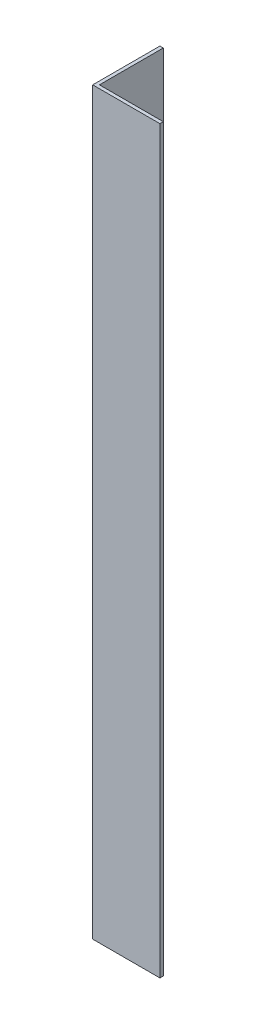
ISO-10303-21;
HEADER;
FILE_DESCRIPTION(('STEP AP214'),'2;1');
FILE_NAME('part.step','',(''),(''),'','','');
FILE_SCHEMA(('AUTOMOTIVE_DESIGN { 1 0 10303 214 1 1 1 1 }'));
ENDSEC;
DATA;
#1=APPLICATION_CONTEXT('core data for automotive mechanical design processes');
#2=APPLICATION_PROTOCOL_DEFINITION('international standard','automotive_design',2000,#1);
#3=PRODUCT_CONTEXT('',#1,'mechanical');
#4=PRODUCT('Part','Part','',(#3));
#5=PRODUCT_RELATED_PRODUCT_CATEGORY('part','',(#4));
#6=PRODUCT_DEFINITION_FORMATION('','',#4);
#7=PRODUCT_DEFINITION_CONTEXT('part definition',#1,'design');
#8=PRODUCT_DEFINITION('design','',#6,#7);
#9=PRODUCT_DEFINITION_SHAPE('','',#8);
#10=(LENGTH_UNIT() NAMED_UNIT(*) SI_UNIT(.MILLI.,.METRE.));
#11=(NAMED_UNIT(*) PLANE_ANGLE_UNIT() SI_UNIT($,.RADIAN.));
#12=(NAMED_UNIT(*) SI_UNIT($,.STERADIAN.) SOLID_ANGLE_UNIT());
#13=UNCERTAINTY_MEASURE_WITH_UNIT(LENGTH_MEASURE(1.E-05),#10,'distance_accuracy_value','');
#14=(GEOMETRIC_REPRESENTATION_CONTEXT(3) GLOBAL_UNCERTAINTY_ASSIGNED_CONTEXT((#13)) GLOBAL_UNIT_ASSIGNED_CONTEXT((#10,
#11,#12)) REPRESENTATION_CONTEXT('',''));
#15=CARTESIAN_POINT('',(0.,0.,0.));
#16=DIRECTION('',(0.,0.,1.));
#17=DIRECTION('',(1.,0.,0.));
#18=AXIS2_PLACEMENT_3D('',#15,#16,#17);
#19=CARTESIAN_POINT('',(20.,220.,0.));
#20=DIRECTION('',(0.,0.,-1.));
#21=DIRECTION('',(-1.,0.,0.));
#22=AXIS2_PLACEMENT_3D('',#19,#20,#21);
#23=PLANE('',#22);
#24=DIRECTION('',(1.,0.,0.));
#25=VECTOR('',#24,1.);
#26=CARTESIAN_POINT('',(20.,0.,0.));
#27=LINE('',#26,#25);
#28=CARTESIAN_POINT('',(0.,0.,0.));
#29=VERTEX_POINT('',#28);
#30=CARTESIAN_POINT('',(20.,0.,0.));
#31=VERTEX_POINT('',#30);
#32=EDGE_CURVE('E121',#29,#31,#27,.T.);
#33=ORIENTED_EDGE('',*,*,#32,.T.);
#34=DIRECTION('',(0.,-1.,0.));
#35=VECTOR('',#34,1.);
#36=CARTESIAN_POINT('',(20.,220.,0.));
#37=LINE('',#36,#35);
#38=CARTESIAN_POINT('',(20.,220.,0.));
#39=VERTEX_POINT('',#38);
#40=EDGE_CURVE('E11',#39,#31,#37,.T.);
#41=ORIENTED_EDGE('',*,*,#40,.F.);
#42=DIRECTION('',(1.,0.,0.));
#43=VECTOR('',#42,1.);
#44=CARTESIAN_POINT('',(20.,220.,0.));
#45=LINE('',#44,#43);
#46=CARTESIAN_POINT('',(0.,220.,0.));
#47=VERTEX_POINT('',#46);
#48=EDGE_CURVE('E132',#47,#39,#45,.T.);
#49=ORIENTED_EDGE('',*,*,#48,.F.);
#50=DIRECTION('',(0.,-1.,0.));
#51=VECTOR('',#50,1.);
#52=CARTESIAN_POINT('',(0.,220.,0.));
#53=LINE('',#52,#51);
#54=EDGE_CURVE('E117',#47,#29,#53,.T.);
#55=ORIENTED_EDGE('',*,*,#54,.T.);
#56=EDGE_LOOP('',(#33,#41,#49,#55));
#57=FACE_BOUND('',#56,.T.);
#58=ADVANCED_FACE('F37',(#57),#23,.F.);
#59=CARTESIAN_POINT('',(20.,220.,-0.999999999999998));
#60=DIRECTION('',(-1.,0.,0.));
#61=DIRECTION('',(0.,0.,1.));
#62=AXIS2_PLACEMENT_3D('',#59,#60,#61);
#63=PLANE('',#62);
#64=DIRECTION('',(0.,0.,-1.));
#65=VECTOR('',#64,1.);
#66=CARTESIAN_POINT('',(20.,0.,-0.999999999999998));
#67=LINE('',#66,#65);
#68=CARTESIAN_POINT('',(20.,0.,-0.999999999999998));
#69=VERTEX_POINT('',#68);
#70=EDGE_CURVE('E124',#31,#69,#67,.T.);
#71=ORIENTED_EDGE('',*,*,#70,.T.);
#72=DIRECTION('',(0.,-1.,0.));
#73=VECTOR('',#72,1.);
#74=CARTESIAN_POINT('',(20.,220.,-0.999999999999998));
#75=LINE('',#74,#73);
#76=CARTESIAN_POINT('',(20.,220.,-0.999999999999998));
#77=VERTEX_POINT('',#76);
#78=EDGE_CURVE('E45',#77,#69,#75,.T.);
#79=ORIENTED_EDGE('',*,*,#78,.F.);
#80=DIRECTION('',(0.,0.,-1.));
#81=VECTOR('',#80,1.);
#82=CARTESIAN_POINT('',(20.,220.,-0.999999999999998));
#83=LINE('',#82,#81);
#84=EDGE_CURVE('E90',#39,#77,#83,.T.);
#85=ORIENTED_EDGE('',*,*,#84,.F.);
#86=ORIENTED_EDGE('',*,*,#40,.T.);
#87=EDGE_LOOP('',(#71,#79,#85,#86));
#88=FACE_BOUND('',#87,.T.);
#89=ADVANCED_FACE('F159',(#88),#63,.F.);
#90=CARTESIAN_POINT('',(1.,220.,-0.999999999999997));
#91=DIRECTION('',(0.,0.,1.));
#92=DIRECTION('',(1.,0.,0.));
#93=AXIS2_PLACEMENT_3D('',#90,#91,#92);
#94=PLANE('',#93);
#95=DIRECTION('',(-1.,0.,0.));
#96=VECTOR('',#95,1.);
#97=CARTESIAN_POINT('',(1.,0.,-0.999999999999997));
#98=LINE('',#97,#96);
#99=CARTESIAN_POINT('',(1.,0.,-0.999999999999997));
#100=VERTEX_POINT('',#99);
#101=EDGE_CURVE('E127',#69,#100,#98,.T.);
#102=ORIENTED_EDGE('',*,*,#101,.T.);
#103=DIRECTION('',(0.,-1.,0.));
#104=VECTOR('',#103,1.);
#105=CARTESIAN_POINT('',(1.,220.,-0.999999999999997));
#106=LINE('',#105,#104);
#107=CARTESIAN_POINT('',(1.,220.,-0.999999999999997));
#108=VERTEX_POINT('',#107);
#109=EDGE_CURVE('E112',#108,#100,#106,.T.);
#110=ORIENTED_EDGE('',*,*,#109,.F.);
#111=DIRECTION('',(-1.,0.,0.));
#112=VECTOR('',#111,1.);
#113=CARTESIAN_POINT('',(1.,220.,-0.999999999999997));
#114=LINE('',#113,#112);
#115=EDGE_CURVE('E103',#77,#108,#114,.T.);
#116=ORIENTED_EDGE('',*,*,#115,.F.);
#117=ORIENTED_EDGE('',*,*,#78,.T.);
#118=EDGE_LOOP('',(#102,#110,#116,#117));
#119=FACE_BOUND('',#118,.T.);
#120=ADVANCED_FACE('F138',(#119),#94,.F.);
#121=CARTESIAN_POINT('',(0.999999999999998,220.,-20.));
#122=DIRECTION('',(-1.,0.,0.));
#123=DIRECTION('',(0.,0.,1.));
#124=AXIS2_PLACEMENT_3D('',#121,#122,#123);
#125=PLANE('',#124);
#126=CARTESIAN_POINT('',(0.999999999999999,40.,-10.5));
#127=DIRECTION('',(1.,0.,0.));
#128=DIRECTION('',(0.,0.,-1.));
#129=AXIS2_PLACEMENT_3D('',#126,#127,#128);
#130=CIRCLE('',#129,4.25000000000001);
#131=CARTESIAN_POINT('',(0.999999999999999,40.,-14.75));
#132=VERTEX_POINT('',#131);
#133=EDGE_CURVE('E175',#132,#132,#130,.T.);
#134=ORIENTED_EDGE('',*,*,#133,.F.);
#135=EDGE_LOOP('',(#134));
#136=FACE_BOUND('',#135,.T.);
#137=CARTESIAN_POINT('',(0.999999999999999,110.,-10.5));
#138=DIRECTION('',(1.,0.,0.));
#139=DIRECTION('',(0.,0.,-1.));
#140=AXIS2_PLACEMENT_3D('',#137,#138,#139);
#141=CIRCLE('',#140,4.25000000000001);
#142=CARTESIAN_POINT('',(0.999999999999999,110.,-14.75));
#143=VERTEX_POINT('',#142);
#144=EDGE_CURVE('E179',#143,#143,#141,.T.);
#145=ORIENTED_EDGE('',*,*,#144,.F.);
#146=EDGE_LOOP('',(#145));
#147=FACE_BOUND('',#146,.T.);
#148=CARTESIAN_POINT('',(0.999999999999999,180.,-10.5));
#149=DIRECTION('',(1.,0.,0.));
#150=DIRECTION('',(0.,0.,-1.));
#151=AXIS2_PLACEMENT_3D('',#148,#149,#150);
#152=CIRCLE('',#151,4.25000000000001);
#153=CARTESIAN_POINT('',(0.999999999999999,180.,-14.75));
#154=VERTEX_POINT('',#153);
#155=EDGE_CURVE('E182',#154,#154,#152,.T.);
#156=ORIENTED_EDGE('',*,*,#155,.F.);
#157=EDGE_LOOP('',(#156));
#158=FACE_BOUND('',#157,.T.);
#159=DIRECTION('',(0.,0.,-1.));
#160=VECTOR('',#159,1.);
#161=CARTESIAN_POINT('',(0.999999999999998,0.,-20.));
#162=LINE('',#161,#160);
#163=CARTESIAN_POINT('',(0.999999999999998,0.,-20.));
#164=VERTEX_POINT('',#163);
#165=EDGE_CURVE('E111',#100,#164,#162,.T.);
#166=ORIENTED_EDGE('',*,*,#165,.T.);
#167=DIRECTION('',(0.,-1.,0.));
#168=VECTOR('',#167,1.);
#169=CARTESIAN_POINT('',(0.999999999999998,220.,-20.));
#170=LINE('',#169,#168);
#171=CARTESIAN_POINT('',(0.999999999999998,220.,-20.));
#172=VERTEX_POINT('',#171);
#173=EDGE_CURVE('E108',#172,#164,#170,.T.);
#174=ORIENTED_EDGE('',*,*,#173,.F.);
#175=DIRECTION('',(0.,0.,-1.));
#176=VECTOR('',#175,1.);
#177=CARTESIAN_POINT('',(0.999999999999998,220.,-20.));
#178=LINE('',#177,#176);
#179=EDGE_CURVE('E97',#108,#172,#178,.T.);
#180=ORIENTED_EDGE('',*,*,#179,.F.);
#181=ORIENTED_EDGE('',*,*,#109,.T.);
#182=EDGE_LOOP('',(#166,#174,#180,#181));
#183=FACE_BOUND('',#182,.T.);
#184=ADVANCED_FACE('F109',(#136,#147,#158,#183),#125,.F.);
#185=CARTESIAN_POINT('',(0.,220.,-20.));
#186=DIRECTION('',(0.,0.,1.));
#187=DIRECTION('',(1.,0.,0.));
#188=AXIS2_PLACEMENT_3D('',#185,#186,#187);
#189=PLANE('',#188);
#190=DIRECTION('',(-1.,0.,0.));
#191=VECTOR('',#190,1.);
#192=CARTESIAN_POINT('',(0.,0.,-20.));
#193=LINE('',#192,#191);
#194=CARTESIAN_POINT('',(0.,0.,-20.));
#195=VERTEX_POINT('',#194);
#196=EDGE_CURVE('E76',#164,#195,#193,.T.);
#197=ORIENTED_EDGE('',*,*,#196,.T.);
#198=DIRECTION('',(0.,-1.,0.));
#199=VECTOR('',#198,1.);
#200=CARTESIAN_POINT('',(0.,220.,-20.));
#201=LINE('',#200,#199);
#202=CARTESIAN_POINT('',(0.,220.,-20.));
#203=VERTEX_POINT('',#202);
#204=EDGE_CURVE('E113',#203,#195,#201,.T.);
#205=ORIENTED_EDGE('',*,*,#204,.F.);
#206=DIRECTION('',(-1.,0.,0.));
#207=VECTOR('',#206,1.);
#208=CARTESIAN_POINT('',(0.,220.,-20.));
#209=LINE('',#208,#207);
#210=EDGE_CURVE('E101',#172,#203,#209,.T.);
#211=ORIENTED_EDGE('',*,*,#210,.F.);
#212=ORIENTED_EDGE('',*,*,#173,.T.);
#213=EDGE_LOOP('',(#197,#205,#211,#212));
#214=FACE_BOUND('',#213,.T.);
#215=ADVANCED_FACE('F115',(#214),#189,.F.);
#216=CARTESIAN_POINT('',(0.,220.,0.));
#217=DIRECTION('',(1.,0.,0.));
#218=DIRECTION('',(0.,0.,-1.));
#219=AXIS2_PLACEMENT_3D('',#216,#217,#218);
#220=PLANE('',#219);
#221=CARTESIAN_POINT('',(0.,40.,-10.5));
#222=DIRECTION('',(1.,0.,0.));
#223=DIRECTION('',(0.,0.,-1.));
#224=AXIS2_PLACEMENT_3D('',#221,#222,#223);
#225=CIRCLE('',#224,4.25000000000001);
#226=CARTESIAN_POINT('',(0.,40.,-14.75));
#227=VERTEX_POINT('',#226);
#228=EDGE_CURVE('E193',#227,#227,#225,.T.);
#229=ORIENTED_EDGE('',*,*,#228,.T.);
#230=EDGE_LOOP('',(#229));
#231=FACE_BOUND('',#230,.T.);
#232=CARTESIAN_POINT('',(0.,110.,-10.5));
#233=DIRECTION('',(1.,0.,0.));
#234=DIRECTION('',(0.,0.,-1.));
#235=AXIS2_PLACEMENT_3D('',#232,#233,#234);
#236=CIRCLE('',#235,4.25000000000001);
#237=CARTESIAN_POINT('',(0.,110.,-14.75));
#238=VERTEX_POINT('',#237);
#239=EDGE_CURVE('E184',#238,#238,#236,.T.);
#240=ORIENTED_EDGE('',*,*,#239,.T.);
#241=EDGE_LOOP('',(#240));
#242=FACE_BOUND('',#241,.T.);
#243=CARTESIAN_POINT('',(0.,180.,-10.5));
#244=DIRECTION('',(1.,0.,0.));
#245=DIRECTION('',(0.,0.,-1.));
#246=AXIS2_PLACEMENT_3D('',#243,#244,#245);
#247=CIRCLE('',#246,4.25000000000001);
#248=CARTESIAN_POINT('',(0.,180.,-14.75));
#249=VERTEX_POINT('',#248);
#250=EDGE_CURVE('E125',#249,#249,#247,.T.);
#251=ORIENTED_EDGE('',*,*,#250,.T.);
#252=EDGE_LOOP('',(#251));
#253=FACE_BOUND('',#252,.T.);
#254=DIRECTION('',(0.,0.,1.));
#255=VECTOR('',#254,1.);
#256=CARTESIAN_POINT('',(0.,0.,0.));
#257=LINE('',#256,#255);
#258=EDGE_CURVE('E82',#195,#29,#257,.T.);
#259=ORIENTED_EDGE('',*,*,#258,.T.);
#260=ORIENTED_EDGE('',*,*,#54,.F.);
#261=DIRECTION('',(0.,0.,1.));
#262=VECTOR('',#261,1.);
#263=CARTESIAN_POINT('',(0.,220.,0.));
#264=LINE('',#263,#262);
#265=EDGE_CURVE('E53',#203,#47,#264,.T.);
#266=ORIENTED_EDGE('',*,*,#265,.F.);
#267=ORIENTED_EDGE('',*,*,#204,.T.);
#268=EDGE_LOOP('',(#259,#260,#266,#267));
#269=FACE_BOUND('',#268,.T.);
#270=ADVANCED_FACE('F145',(#231,#242,#253,#269),#220,.F.);
#271=CARTESIAN_POINT('',(0.,220.,0.));
#272=DIRECTION('',(0.,-1.,0.));
#273=DIRECTION('',(0.,0.,-1.));
#274=AXIS2_PLACEMENT_3D('',#271,#272,#273);
#275=PLANE('',#274);
#276=ORIENTED_EDGE('',*,*,#48,.T.);
#277=ORIENTED_EDGE('',*,*,#84,.T.);
#278=ORIENTED_EDGE('',*,*,#115,.T.);
#279=ORIENTED_EDGE('',*,*,#179,.T.);
#280=ORIENTED_EDGE('',*,*,#210,.T.);
#281=ORIENTED_EDGE('',*,*,#265,.T.);
#282=EDGE_LOOP('',(#276,#277,#278,#279,#280,#281));
#283=FACE_BOUND('',#282,.T.);
#284=ADVANCED_FACE('F99',(#283),#275,.F.);
#285=CARTESIAN_POINT('',(0.,0.,0.));
#286=DIRECTION('',(0.,-1.,0.));
#287=DIRECTION('',(0.,0.,-1.));
#288=AXIS2_PLACEMENT_3D('',#285,#286,#287);
#289=PLANE('',#288);
#290=ORIENTED_EDGE('',*,*,#32,.F.);
#291=ORIENTED_EDGE('',*,*,#258,.F.);
#292=ORIENTED_EDGE('',*,*,#196,.F.);
#293=ORIENTED_EDGE('',*,*,#165,.F.);
#294=ORIENTED_EDGE('',*,*,#101,.F.);
#295=ORIENTED_EDGE('',*,*,#70,.F.);
#296=EDGE_LOOP('',(#290,#291,#292,#293,#294,#295));
#297=FACE_BOUND('',#296,.T.);
#298=ADVANCED_FACE('F141',(#297),#289,.T.);
#299=CARTESIAN_POINT('',(0.,180.,-10.5));
#300=DIRECTION('',(1.,0.,0.));
#301=DIRECTION('',(0.,0.,-1.));
#302=AXIS2_PLACEMENT_3D('',#299,#300,#301);
#303=CYLINDRICAL_SURFACE('',#302,4.25000000000001);
#304=ORIENTED_EDGE('',*,*,#250,.F.);
#305=EDGE_LOOP('',(#304));
#306=FACE_BOUND('',#305,.T.);
#307=ORIENTED_EDGE('',*,*,#155,.T.);
#308=EDGE_LOOP('',(#307));
#309=FACE_BOUND('',#308,.T.);
#310=ADVANCED_FACE('F206',(#306,#309),#303,.F.);
#311=CARTESIAN_POINT('',(0.,110.,-10.5));
#312=DIRECTION('',(1.,0.,0.));
#313=DIRECTION('',(0.,0.,-1.));
#314=AXIS2_PLACEMENT_3D('',#311,#312,#313);
#315=CYLINDRICAL_SURFACE('',#314,4.25000000000001);
#316=ORIENTED_EDGE('',*,*,#239,.F.);
#317=EDGE_LOOP('',(#316));
#318=FACE_BOUND('',#317,.T.);
#319=ORIENTED_EDGE('',*,*,#144,.T.);
#320=EDGE_LOOP('',(#319));
#321=FACE_BOUND('',#320,.T.);
#322=ADVANCED_FACE('F201',(#318,#321),#315,.F.);
#323=CARTESIAN_POINT('',(0.,40.,-10.5));
#324=DIRECTION('',(1.,0.,0.));
#325=DIRECTION('',(0.,0.,-1.));
#326=AXIS2_PLACEMENT_3D('',#323,#324,#325);
#327=CYLINDRICAL_SURFACE('',#326,4.25000000000001);
#328=ORIENTED_EDGE('',*,*,#228,.F.);
#329=EDGE_LOOP('',(#328));
#330=FACE_BOUND('',#329,.T.);
#331=ORIENTED_EDGE('',*,*,#133,.T.);
#332=EDGE_LOOP('',(#331));
#333=FACE_BOUND('',#332,.T.);
#334=ADVANCED_FACE('F198',(#330,#333),#327,.F.);
#335=CLOSED_SHELL('',(#58,#89,#120,#184,#215,#270,#284,#298,#310,#322,#334));
#336=MANIFOLD_SOLID_BREP('B2',#335);
#337=ADVANCED_BREP_SHAPE_REPRESENTATION('',(#18,#336),#14);
#338=SHAPE_DEFINITION_REPRESENTATION(#9,#337);
ENDSEC;
END-ISO-10303-21;
